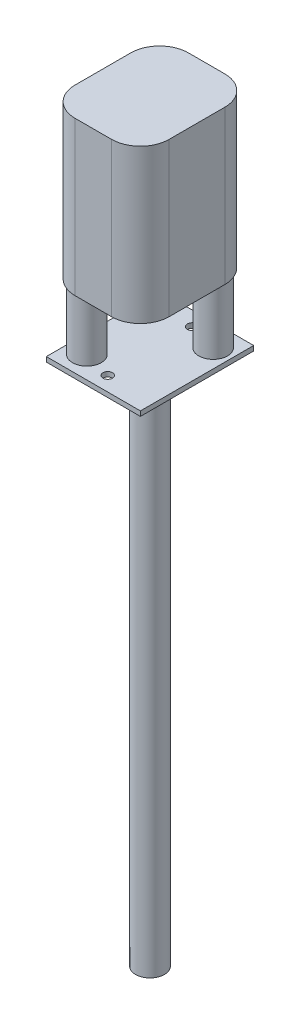
ISO-10303-21;
HEADER;
FILE_DESCRIPTION(('STEP AP214'),'2;1');
FILE_NAME('part.step','',(''),(''),'','','');
FILE_SCHEMA(('AUTOMOTIVE_DESIGN { 1 0 10303 214 1 1 1 1 }'));
ENDSEC;
DATA;
#1=APPLICATION_CONTEXT('core data for automotive mechanical design processes');
#2=APPLICATION_PROTOCOL_DEFINITION('international standard','automotive_design',2000,#1);
#3=PRODUCT_CONTEXT('',#1,'mechanical');
#4=PRODUCT('Part','Part','',(#3));
#5=PRODUCT_RELATED_PRODUCT_CATEGORY('part','',(#4));
#6=PRODUCT_DEFINITION_FORMATION('','',#4);
#7=PRODUCT_DEFINITION_CONTEXT('part definition',#1,'design');
#8=PRODUCT_DEFINITION('design','',#6,#7);
#9=PRODUCT_DEFINITION_SHAPE('','',#8);
#10=(LENGTH_UNIT() NAMED_UNIT(*) SI_UNIT(.MILLI.,.METRE.));
#11=(NAMED_UNIT(*) PLANE_ANGLE_UNIT() SI_UNIT($,.RADIAN.));
#12=(NAMED_UNIT(*) SI_UNIT($,.STERADIAN.) SOLID_ANGLE_UNIT());
#13=UNCERTAINTY_MEASURE_WITH_UNIT(LENGTH_MEASURE(1.E-05),#10,'distance_accuracy_value','');
#14=(GEOMETRIC_REPRESENTATION_CONTEXT(3) GLOBAL_UNCERTAINTY_ASSIGNED_CONTEXT((#13)) GLOBAL_UNIT_ASSIGNED_CONTEXT((#10,
#11,#12)) REPRESENTATION_CONTEXT('',''));
#15=CARTESIAN_POINT('',(0.,0.,0.));
#16=DIRECTION('',(0.,0.,1.));
#17=DIRECTION('',(1.,0.,0.));
#18=AXIS2_PLACEMENT_3D('',#15,#16,#17);
#19=CARTESIAN_POINT('',(-4.9,0.5,5.9));
#20=DIRECTION('',(1.,0.,0.));
#21=DIRECTION('',(0.,0.,-1.));
#22=AXIS2_PLACEMENT_3D('',#19,#20,#21);
#23=PLANE('',#22);
#24=DIRECTION('',(0.,0.,1.));
#25=VECTOR('',#24,1.);
#26=CARTESIAN_POINT('',(-4.9,0.,5.9));
#27=LINE('',#26,#25);
#28=CARTESIAN_POINT('',(-4.9,0.,-5.9));
#29=VERTEX_POINT('',#28);
#30=CARTESIAN_POINT('',(-4.9,0.,5.9));
#31=VERTEX_POINT('',#30);
#32=EDGE_CURVE('E190',#29,#31,#27,.T.);
#33=ORIENTED_EDGE('',*,*,#32,.T.);
#34=DIRECTION('',(0.,-1.,0.));
#35=VECTOR('',#34,1.);
#36=CARTESIAN_POINT('',(-4.9,0.5,5.9));
#37=LINE('',#36,#35);
#38=CARTESIAN_POINT('',(-4.9,0.5,5.9));
#39=VERTEX_POINT('',#38);
#40=EDGE_CURVE('E37',#39,#31,#37,.T.);
#41=ORIENTED_EDGE('',*,*,#40,.F.);
#42=DIRECTION('',(0.,0.,1.));
#43=VECTOR('',#42,1.);
#44=CARTESIAN_POINT('',(-4.9,0.5,5.9));
#45=LINE('',#44,#43);
#46=CARTESIAN_POINT('',(-4.9,0.5,-5.9));
#47=VERTEX_POINT('',#46);
#48=EDGE_CURVE('E192',#47,#39,#45,.T.);
#49=ORIENTED_EDGE('',*,*,#48,.F.);
#50=DIRECTION('',(0.,-1.,0.));
#51=VECTOR('',#50,1.);
#52=CARTESIAN_POINT('',(-4.9,0.5,-5.9));
#53=LINE('',#52,#51);
#54=EDGE_CURVE('E198',#47,#29,#53,.T.);
#55=ORIENTED_EDGE('',*,*,#54,.T.);
#56=EDGE_LOOP('',(#33,#41,#49,#55));
#57=FACE_BOUND('',#56,.T.);
#58=ADVANCED_FACE('F34',(#57),#23,.F.);
#59=CARTESIAN_POINT('',(4.9,0.5,5.9));
#60=DIRECTION('',(0.,0.,-1.));
#61=DIRECTION('',(-1.,0.,0.));
#62=AXIS2_PLACEMENT_3D('',#59,#60,#61);
#63=PLANE('',#62);
#64=DIRECTION('',(1.,0.,0.));
#65=VECTOR('',#64,1.);
#66=CARTESIAN_POINT('',(4.9,0.,5.9));
#67=LINE('',#66,#65);
#68=CARTESIAN_POINT('',(4.9,0.,5.9));
#69=VERTEX_POINT('',#68);
#70=EDGE_CURVE('E201',#31,#69,#67,.T.);
#71=ORIENTED_EDGE('',*,*,#70,.T.);
#72=DIRECTION('',(0.,-1.,0.));
#73=VECTOR('',#72,1.);
#74=CARTESIAN_POINT('',(4.9,0.5,5.9));
#75=LINE('',#74,#73);
#76=CARTESIAN_POINT('',(4.9,0.5,5.9));
#77=VERTEX_POINT('',#76);
#78=EDGE_CURVE('E207',#77,#69,#75,.T.);
#79=ORIENTED_EDGE('',*,*,#78,.F.);
#80=DIRECTION('',(1.,0.,0.));
#81=VECTOR('',#80,1.);
#82=CARTESIAN_POINT('',(4.9,0.5,5.9));
#83=LINE('',#82,#81);
#84=EDGE_CURVE('E83',#39,#77,#83,.T.);
#85=ORIENTED_EDGE('',*,*,#84,.F.);
#86=ORIENTED_EDGE('',*,*,#40,.T.);
#87=EDGE_LOOP('',(#71,#79,#85,#86));
#88=FACE_BOUND('',#87,.T.);
#89=ADVANCED_FACE('F210',(#88),#63,.F.);
#90=CARTESIAN_POINT('',(4.9,0.5,5.9));
#91=DIRECTION('',(-1.,0.,0.));
#92=DIRECTION('',(0.,0.,1.));
#93=AXIS2_PLACEMENT_3D('',#90,#91,#92);
#94=PLANE('',#93);
#95=DIRECTION('',(0.,0.,-1.));
#96=VECTOR('',#95,1.);
#97=CARTESIAN_POINT('',(4.9,0.,5.9));
#98=LINE('',#97,#96);
#99=CARTESIAN_POINT('',(4.9,0.,-5.9));
#100=VERTEX_POINT('',#99);
#101=EDGE_CURVE('E69',#69,#100,#98,.T.);
#102=ORIENTED_EDGE('',*,*,#101,.T.);
#103=DIRECTION('',(0.,-1.,0.));
#104=VECTOR('',#103,1.);
#105=CARTESIAN_POINT('',(4.9,0.5,-5.9));
#106=LINE('',#105,#104);
#107=CARTESIAN_POINT('',(4.9,0.5,-5.9));
#108=VERTEX_POINT('',#107);
#109=EDGE_CURVE('E206',#108,#100,#106,.T.);
#110=ORIENTED_EDGE('',*,*,#109,.F.);
#111=DIRECTION('',(0.,0.,-1.));
#112=VECTOR('',#111,1.);
#113=CARTESIAN_POINT('',(4.9,0.5,5.9));
#114=LINE('',#113,#112);
#115=EDGE_CURVE('E195',#77,#108,#114,.T.);
#116=ORIENTED_EDGE('',*,*,#115,.F.);
#117=ORIENTED_EDGE('',*,*,#78,.T.);
#118=EDGE_LOOP('',(#102,#110,#116,#117));
#119=FACE_BOUND('',#118,.T.);
#120=ADVANCED_FACE('F238',(#119),#94,.F.);
#121=CARTESIAN_POINT('',(4.9,0.5,-5.9));
#122=DIRECTION('',(0.,0.,1.));
#123=DIRECTION('',(1.,0.,0.));
#124=AXIS2_PLACEMENT_3D('',#121,#122,#123);
#125=PLANE('',#124);
#126=DIRECTION('',(-1.,0.,0.));
#127=VECTOR('',#126,1.);
#128=CARTESIAN_POINT('',(4.9,0.,-5.9));
#129=LINE('',#128,#127);
#130=EDGE_CURVE('E75',#100,#29,#129,.T.);
#131=ORIENTED_EDGE('',*,*,#130,.T.);
#132=ORIENTED_EDGE('',*,*,#54,.F.);
#133=DIRECTION('',(-1.,0.,0.));
#134=VECTOR('',#133,1.);
#135=CARTESIAN_POINT('',(4.9,0.5,-5.9));
#136=LINE('',#135,#134);
#137=EDGE_CURVE('E51',#108,#47,#136,.T.);
#138=ORIENTED_EDGE('',*,*,#137,.F.);
#139=ORIENTED_EDGE('',*,*,#109,.T.);
#140=EDGE_LOOP('',(#131,#132,#138,#139));
#141=FACE_BOUND('',#140,.T.);
#142=ADVANCED_FACE('F228',(#141),#125,.F.);
#143=CARTESIAN_POINT('',(0.,0.5,0.));
#144=DIRECTION('',(0.,1.,0.));
#145=DIRECTION('',(0.,0.,1.));
#146=AXIS2_PLACEMENT_3D('',#143,#144,#145);
#147=PLANE('',#146);
#148=CARTESIAN_POINT('',(2.98329699091761,0.5,-3.59213311151304));
#149=DIRECTION('',(0.,1.,0.));
#150=DIRECTION('',(0.,0.,-1.));
#151=AXIS2_PLACEMENT_3D('',#148,#149,#150);
#152=CIRCLE('',#151,1.5);
#153=CARTESIAN_POINT('',(2.98329699091761,0.5,-5.09213311151304));
#154=VERTEX_POINT('',#153);
#155=EDGE_CURVE('E159',#154,#154,#152,.T.);
#156=ORIENTED_EDGE('',*,*,#155,.F.);
#157=EDGE_LOOP('',(#156));
#158=FACE_BOUND('',#157,.T.);
#159=CARTESIAN_POINT('',(-2.98329699091761,0.5,3.59213311151304));
#160=DIRECTION('',(0.,1.,0.));
#161=DIRECTION('',(0.,0.,1.));
#162=AXIS2_PLACEMENT_3D('',#159,#160,#161);
#163=CIRCLE('',#162,1.5);
#164=CARTESIAN_POINT('',(-2.98329699091761,0.5,5.09213311151304));
#165=VERTEX_POINT('',#164);
#166=EDGE_CURVE('E169',#165,#165,#163,.T.);
#167=ORIENTED_EDGE('',*,*,#166,.F.);
#168=EDGE_LOOP('',(#167));
#169=FACE_BOUND('',#168,.T.);
#170=CARTESIAN_POINT('',(0.,0.5,4.4));
#171=DIRECTION('',(0.,1.,0.));
#172=DIRECTION('',(0.,0.,1.));
#173=AXIS2_PLACEMENT_3D('',#170,#171,#172);
#174=CIRCLE('',#173,0.5);
#175=CARTESIAN_POINT('',(0.,0.5,4.9));
#176=VERTEX_POINT('',#175);
#177=EDGE_CURVE('E185',#176,#176,#174,.T.);
#178=ORIENTED_EDGE('',*,*,#177,.F.);
#179=EDGE_LOOP('',(#178));
#180=FACE_BOUND('',#179,.T.);
#181=CARTESIAN_POINT('',(0.,0.5,-4.4));
#182=DIRECTION('',(0.,1.,0.));
#183=DIRECTION('',(0.,0.,1.));
#184=AXIS2_PLACEMENT_3D('',#181,#182,#183);
#185=CIRCLE('',#184,0.5);
#186=CARTESIAN_POINT('',(0.,0.5,-3.9));
#187=VERTEX_POINT('',#186);
#188=EDGE_CURVE('E180',#187,#187,#185,.T.);
#189=ORIENTED_EDGE('',*,*,#188,.F.);
#190=EDGE_LOOP('',(#189));
#191=FACE_BOUND('',#190,.T.);
#192=ORIENTED_EDGE('',*,*,#48,.T.);
#193=ORIENTED_EDGE('',*,*,#84,.T.);
#194=ORIENTED_EDGE('',*,*,#115,.T.);
#195=ORIENTED_EDGE('',*,*,#137,.T.);
#196=EDGE_LOOP('',(#192,#193,#194,#195));
#197=FACE_BOUND('',#196,.T.);
#198=ADVANCED_FACE('F218',(#158,#169,#180,#191,#197),#147,.T.);
#199=CARTESIAN_POINT('',(0.,0.,0.));
#200=DIRECTION('',(0.,1.,0.));
#201=DIRECTION('',(0.,0.,1.));
#202=AXIS2_PLACEMENT_3D('',#199,#200,#201);
#203=PLANE('',#202);
#204=CARTESIAN_POINT('',(0.,0.,4.4));
#205=DIRECTION('',(0.,-1.,0.));
#206=DIRECTION('',(0.,0.,-1.));
#207=AXIS2_PLACEMENT_3D('',#204,#205,#206);
#208=CIRCLE('',#207,0.5);
#209=CARTESIAN_POINT('',(0.,0.,3.9));
#210=VERTEX_POINT('',#209);
#211=EDGE_CURVE('E177',#210,#210,#208,.T.);
#212=ORIENTED_EDGE('',*,*,#211,.F.);
#213=EDGE_LOOP('',(#212));
#214=FACE_BOUND('',#213,.T.);
#215=CARTESIAN_POINT('',(0.,0.,-4.4));
#216=DIRECTION('',(0.,-1.,0.));
#217=DIRECTION('',(0.,0.,1.));
#218=AXIS2_PLACEMENT_3D('',#215,#216,#217);
#219=CIRCLE('',#218,0.5);
#220=CARTESIAN_POINT('',(0.,0.,-3.9));
#221=VERTEX_POINT('',#220);
#222=EDGE_CURVE('E174',#221,#221,#219,.T.);
#223=ORIENTED_EDGE('',*,*,#222,.F.);
#224=EDGE_LOOP('',(#223));
#225=FACE_BOUND('',#224,.T.);
#226=CARTESIAN_POINT('',(0.,0.,0.));
#227=DIRECTION('',(0.,-1.,0.));
#228=DIRECTION('',(0.,0.,-1.));
#229=AXIS2_PLACEMENT_3D('',#226,#227,#228);
#230=CIRCLE('',#229,1.5);
#231=CARTESIAN_POINT('',(0.,0.,-1.5));
#232=VERTEX_POINT('',#231);
#233=EDGE_CURVE('E11',#232,#232,#230,.T.);
#234=ORIENTED_EDGE('',*,*,#233,.F.);
#235=EDGE_LOOP('',(#234));
#236=FACE_BOUND('',#235,.T.);
#237=ORIENTED_EDGE('',*,*,#32,.F.);
#238=ORIENTED_EDGE('',*,*,#130,.F.);
#239=ORIENTED_EDGE('',*,*,#101,.F.);
#240=ORIENTED_EDGE('',*,*,#70,.F.);
#241=EDGE_LOOP('',(#237,#238,#239,#240));
#242=FACE_BOUND('',#241,.T.);
#243=ADVANCED_FACE('F215',(#214,#225,#236,#242),#203,.F.);
#244=CARTESIAN_POINT('',(0.,-55.,0.));
#245=DIRECTION('',(0.,1.,0.));
#246=DIRECTION('',(0.,0.,1.));
#247=AXIS2_PLACEMENT_3D('',#244,#245,#246);
#248=CYLINDRICAL_SURFACE('',#247,1.5);
#249=CARTESIAN_POINT('',(0.,-55.,0.));
#250=DIRECTION('',(0.,-1.,0.));
#251=DIRECTION('',(0.,0.,-1.));
#252=AXIS2_PLACEMENT_3D('',#249,#250,#251);
#253=CIRCLE('',#252,1.5);
#254=CARTESIAN_POINT('',(0.,-55.,-1.5));
#255=VERTEX_POINT('',#254);
#256=EDGE_CURVE('E188',#255,#255,#253,.T.);
#257=ORIENTED_EDGE('',*,*,#256,.F.);
#258=EDGE_LOOP('',(#257));
#259=FACE_BOUND('',#258,.T.);
#260=ORIENTED_EDGE('',*,*,#233,.T.);
#261=EDGE_LOOP('',(#260));
#262=FACE_BOUND('',#261,.T.);
#263=ADVANCED_FACE('F217',(#259,#262),#248,.T.);
#264=CARTESIAN_POINT('',(0.,-55.,0.));
#265=DIRECTION('',(0.,-1.,0.));
#266=DIRECTION('',(0.,0.,-1.));
#267=AXIS2_PLACEMENT_3D('',#264,#265,#266);
#268=PLANE('',#267);
#269=ORIENTED_EDGE('',*,*,#256,.T.);
#270=EDGE_LOOP('',(#269));
#271=FACE_BOUND('',#270,.T.);
#272=ADVANCED_FACE('F225',(#271),#268,.T.);
#273=CARTESIAN_POINT('',(0.,55.,-4.4));
#274=DIRECTION('',(0.,-1.,0.));
#275=DIRECTION('',(0.,0.,-1.));
#276=AXIS2_PLACEMENT_3D('',#273,#274,#275);
#277=CYLINDRICAL_SURFACE('',#276,0.5);
#278=ORIENTED_EDGE('',*,*,#188,.T.);
#279=EDGE_LOOP('',(#278));
#280=FACE_BOUND('',#279,.T.);
#281=ORIENTED_EDGE('',*,*,#222,.T.);
#282=EDGE_LOOP('',(#281));
#283=FACE_BOUND('',#282,.T.);
#284=ADVANCED_FACE('F381',(#280,#283),#277,.F.);
#285=CARTESIAN_POINT('',(0.,55.,4.4));
#286=DIRECTION('',(0.,-1.,0.));
#287=DIRECTION('',(0.,0.,-1.));
#288=AXIS2_PLACEMENT_3D('',#285,#286,#287);
#289=CYLINDRICAL_SURFACE('',#288,0.5);
#290=ORIENTED_EDGE('',*,*,#177,.T.);
#291=EDGE_LOOP('',(#290));
#292=FACE_BOUND('',#291,.T.);
#293=ORIENTED_EDGE('',*,*,#211,.T.);
#294=EDGE_LOOP('',(#293));
#295=FACE_BOUND('',#294,.T.);
#296=ADVANCED_FACE('F260',(#292,#295),#289,.F.);
#297=CARTESIAN_POINT('',(-2.98329699091761,7.5,3.59213311151304));
#298=DIRECTION('',(0.,-1.,0.));
#299=DIRECTION('',(0.,0.,-1.));
#300=AXIS2_PLACEMENT_3D('',#297,#298,#299);
#301=CYLINDRICAL_SURFACE('',#300,1.5);
#302=CARTESIAN_POINT('',(-2.98329699091761,7.5,3.59213311151304));
#303=DIRECTION('',(0.,1.,0.));
#304=DIRECTION('',(0.,0.,1.));
#305=AXIS2_PLACEMENT_3D('',#302,#303,#304);
#306=CIRCLE('',#305,1.5);
#307=CARTESIAN_POINT('',(-2.98329699091761,7.5,5.09213311151304));
#308=VERTEX_POINT('',#307);
#309=EDGE_CURVE('E171',#308,#308,#306,.T.);
#310=ORIENTED_EDGE('',*,*,#309,.F.);
#311=EDGE_LOOP('',(#310));
#312=FACE_BOUND('',#311,.T.);
#313=ORIENTED_EDGE('',*,*,#166,.T.);
#314=EDGE_LOOP('',(#313));
#315=FACE_BOUND('',#314,.T.);
#316=ADVANCED_FACE('F265',(#312,#315),#301,.T.);
#317=CARTESIAN_POINT('',(2.98329699091761,7.5,-3.59213311151304));
#318=DIRECTION('',(0.,-1.,0.));
#319=DIRECTION('',(0.,0.,-1.));
#320=AXIS2_PLACEMENT_3D('',#317,#318,#319);
#321=CYLINDRICAL_SURFACE('',#320,1.5);
#322=CARTESIAN_POINT('',(2.98329699091761,7.5,-3.59213311151304));
#323=DIRECTION('',(0.,1.,0.));
#324=DIRECTION('',(0.,0.,-1.));
#325=AXIS2_PLACEMENT_3D('',#322,#323,#324);
#326=CIRCLE('',#325,1.5);
#327=CARTESIAN_POINT('',(2.98329699091761,7.5,-5.09213311151304));
#328=VERTEX_POINT('',#327);
#329=EDGE_CURVE('E162',#328,#328,#326,.T.);
#330=ORIENTED_EDGE('',*,*,#329,.F.);
#331=EDGE_LOOP('',(#330));
#332=FACE_BOUND('',#331,.T.);
#333=ORIENTED_EDGE('',*,*,#155,.T.);
#334=EDGE_LOOP('',(#333));
#335=FACE_BOUND('',#334,.T.);
#336=ADVANCED_FACE('F270',(#332,#335),#321,.T.);
#337=CARTESIAN_POINT('',(-1.9,23.5,-2.9));
#338=DIRECTION('',(0.,-1.,0.));
#339=DIRECTION('',(0.,0.,-1.));
#340=AXIS2_PLACEMENT_3D('',#337,#338,#339);
#341=CYLINDRICAL_SURFACE('',#340,3.);
#342=CARTESIAN_POINT('',(-1.9,7.5,-2.9));
#343=DIRECTION('',(0.,1.,0.));
#344=DIRECTION('',(0.,0.,1.));
#345=AXIS2_PLACEMENT_3D('',#342,#343,#344);
#346=CIRCLE('',#345,3.);
#347=CARTESIAN_POINT('',(-1.89999999999998,7.5,-5.9));
#348=VERTEX_POINT('',#347);
#349=CARTESIAN_POINT('',(-4.9,7.5,-2.89999999999998));
#350=VERTEX_POINT('',#349);
#351=EDGE_CURVE('E158',#348,#350,#346,.T.);
#352=ORIENTED_EDGE('',*,*,#351,.T.);
#353=DIRECTION('',(0.,-1.,0.));
#354=VECTOR('',#353,1.);
#355=CARTESIAN_POINT('',(-4.9,23.5,-2.89999999999998));
#356=LINE('',#355,#354);
#357=CARTESIAN_POINT('',(-4.9,23.5,-2.89999999999998));
#358=VERTEX_POINT('',#357);
#359=EDGE_CURVE('E138',#358,#350,#356,.T.);
#360=ORIENTED_EDGE('',*,*,#359,.F.);
#361=CARTESIAN_POINT('',(-1.9,23.5,-2.9));
#362=DIRECTION('',(0.,1.,0.));
#363=DIRECTION('',(0.,0.,1.));
#364=AXIS2_PLACEMENT_3D('',#361,#362,#363);
#365=CIRCLE('',#364,3.);
#366=CARTESIAN_POINT('',(-1.89999999999998,23.5,-5.9));
#367=VERTEX_POINT('',#366);
#368=EDGE_CURVE('E145',#367,#358,#365,.T.);
#369=ORIENTED_EDGE('',*,*,#368,.F.);
#370=DIRECTION('',(0.,-1.,0.));
#371=VECTOR('',#370,1.);
#372=CARTESIAN_POINT('',(-1.89999999999998,23.5,-5.9));
#373=LINE('',#372,#371);
#374=EDGE_CURVE('E444',#367,#348,#373,.T.);
#375=ORIENTED_EDGE('',*,*,#374,.T.);
#376=EDGE_LOOP('',(#352,#360,#369,#375));
#377=FACE_BOUND('',#376,.T.);
#378=ADVANCED_FACE('F156',(#377),#341,.T.);
#379=CARTESIAN_POINT('',(-4.9,23.5,-2.89999999999998));
#380=DIRECTION('',(1.,0.,0.));
#381=DIRECTION('',(0.,0.,-1.));
#382=AXIS2_PLACEMENT_3D('',#379,#380,#381);
#383=PLANE('',#382);
#384=DIRECTION('',(0.,0.,1.));
#385=VECTOR('',#384,1.);
#386=CARTESIAN_POINT('',(-4.9,7.5,-2.89999999999998));
#387=LINE('',#386,#385);
#388=CARTESIAN_POINT('',(-4.9,7.5,2.90712827563198));
#389=VERTEX_POINT('',#388);
#390=EDGE_CURVE('E427',#350,#389,#387,.T.);
#391=ORIENTED_EDGE('',*,*,#390,.T.);
#392=DIRECTION('',(0.,-1.,0.));
#393=VECTOR('',#392,1.);
#394=CARTESIAN_POINT('',(-4.9,23.5,2.90712827563198));
#395=LINE('',#394,#393);
#396=CARTESIAN_POINT('',(-4.9,23.5,2.90712827563198));
#397=VERTEX_POINT('',#396);
#398=EDGE_CURVE('E141',#397,#389,#395,.T.);
#399=ORIENTED_EDGE('',*,*,#398,.F.);
#400=DIRECTION('',(0.,0.,1.));
#401=VECTOR('',#400,1.);
#402=CARTESIAN_POINT('',(-4.9,23.5,-2.89999999999998));
#403=LINE('',#402,#401);
#404=EDGE_CURVE('E134',#358,#397,#403,.T.);
#405=ORIENTED_EDGE('',*,*,#404,.F.);
#406=ORIENTED_EDGE('',*,*,#359,.T.);
#407=EDGE_LOOP('',(#391,#399,#405,#406));
#408=FACE_BOUND('',#407,.T.);
#409=ADVANCED_FACE('F136',(#408),#383,.F.);
#410=CARTESIAN_POINT('',(-1.9,23.5,2.907128275632));
#411=DIRECTION('',(0.,-1.,0.));
#412=DIRECTION('',(0.,0.,-1.));
#413=AXIS2_PLACEMENT_3D('',#410,#411,#412);
#414=CYLINDRICAL_SURFACE('',#413,3.);
#415=CARTESIAN_POINT('',(-1.9,7.5,2.907128275632));
#416=DIRECTION('',(0.,1.,0.));
#417=DIRECTION('',(0.,0.,-1.));
#418=AXIS2_PLACEMENT_3D('',#415,#416,#417);
#419=CIRCLE('',#418,3.);
#420=CARTESIAN_POINT('',(-1.89999999999998,7.5,5.907128275632));
#421=VERTEX_POINT('',#420);
#422=EDGE_CURVE('E429',#389,#421,#419,.T.);
#423=ORIENTED_EDGE('',*,*,#422,.T.);
#424=DIRECTION('',(0.,-1.,0.));
#425=VECTOR('',#424,1.);
#426=CARTESIAN_POINT('',(-1.89999999999998,23.5,5.907128275632));
#427=LINE('',#426,#425);
#428=CARTESIAN_POINT('',(-1.89999999999998,23.5,5.907128275632));
#429=VERTEX_POINT('',#428);
#430=EDGE_CURVE('E164',#429,#421,#427,.T.);
#431=ORIENTED_EDGE('',*,*,#430,.F.);
#432=CARTESIAN_POINT('',(-1.9,23.5,2.907128275632));
#433=DIRECTION('',(0.,1.,0.));
#434=DIRECTION('',(0.,0.,-1.));
#435=AXIS2_PLACEMENT_3D('',#432,#433,#434);
#436=CIRCLE('',#435,3.);
#437=EDGE_CURVE('E144',#397,#429,#436,.T.);
#438=ORIENTED_EDGE('',*,*,#437,.F.);
#439=ORIENTED_EDGE('',*,*,#398,.T.);
#440=EDGE_LOOP('',(#423,#431,#438,#439));
#441=FACE_BOUND('',#440,.T.);
#442=ADVANCED_FACE('F297',(#441),#414,.T.);
#443=CARTESIAN_POINT('',(-1.89999999999998,23.5,5.907128275632));
#444=DIRECTION('',(0.,0.,-1.));
#445=DIRECTION('',(-1.,0.,0.));
#446=AXIS2_PLACEMENT_3D('',#443,#444,#445);
#447=PLANE('',#446);
#448=DIRECTION('',(1.,0.,0.));
#449=VECTOR('',#448,1.);
#450=CARTESIAN_POINT('',(-1.89999999999998,7.5,5.907128275632));
#451=LINE('',#450,#449);
#452=CARTESIAN_POINT('',(1.89999999999998,7.5,5.907128275632));
#453=VERTEX_POINT('',#452);
#454=EDGE_CURVE('E435',#421,#453,#451,.T.);
#455=ORIENTED_EDGE('',*,*,#454,.T.);
#456=DIRECTION('',(0.,-1.,0.));
#457=VECTOR('',#456,1.);
#458=CARTESIAN_POINT('',(1.89999999999998,23.5,5.907128275632));
#459=LINE('',#458,#457);
#460=CARTESIAN_POINT('',(1.89999999999998,23.5,5.907128275632));
#461=VERTEX_POINT('',#460);
#462=EDGE_CURVE('E455',#461,#453,#459,.T.);
#463=ORIENTED_EDGE('',*,*,#462,.F.);
#464=DIRECTION('',(1.,0.,0.));
#465=VECTOR('',#464,1.);
#466=CARTESIAN_POINT('',(-1.89999999999998,23.5,5.907128275632));
#467=LINE('',#466,#465);
#468=EDGE_CURVE('E462',#429,#461,#467,.T.);
#469=ORIENTED_EDGE('',*,*,#468,.F.);
#470=ORIENTED_EDGE('',*,*,#430,.T.);
#471=EDGE_LOOP('',(#455,#463,#469,#470));
#472=FACE_BOUND('',#471,.T.);
#473=ADVANCED_FACE('F306',(#472),#447,.F.);
#474=CARTESIAN_POINT('',(1.9,23.5,2.907128275632));
#475=DIRECTION('',(0.,-1.,0.));
#476=DIRECTION('',(0.,0.,-1.));
#477=AXIS2_PLACEMENT_3D('',#474,#475,#476);
#478=CYLINDRICAL_SURFACE('',#477,3.);
#479=CARTESIAN_POINT('',(1.9,7.5,2.907128275632));
#480=DIRECTION('',(0.,1.,0.));
#481=DIRECTION('',(0.,0.,1.));
#482=AXIS2_PLACEMENT_3D('',#479,#480,#481);
#483=CIRCLE('',#482,3.);
#484=CARTESIAN_POINT('',(4.9,7.5,2.90712827563197));
#485=VERTEX_POINT('',#484);
#486=EDGE_CURVE('E437',#453,#485,#483,.T.);
#487=ORIENTED_EDGE('',*,*,#486,.T.);
#488=DIRECTION('',(0.,-1.,0.));
#489=VECTOR('',#488,1.);
#490=CARTESIAN_POINT('',(4.9,23.5,2.90712827563197));
#491=LINE('',#490,#489);
#492=CARTESIAN_POINT('',(4.9,23.5,2.90712827563197));
#493=VERTEX_POINT('',#492);
#494=EDGE_CURVE('E452',#493,#485,#491,.T.);
#495=ORIENTED_EDGE('',*,*,#494,.F.);
#496=CARTESIAN_POINT('',(1.9,23.5,2.907128275632));
#497=DIRECTION('',(0.,1.,0.));
#498=DIRECTION('',(0.,0.,1.));
#499=AXIS2_PLACEMENT_3D('',#496,#497,#498);
#500=CIRCLE('',#499,3.);
#501=EDGE_CURVE('E472',#461,#493,#500,.T.);
#502=ORIENTED_EDGE('',*,*,#501,.F.);
#503=ORIENTED_EDGE('',*,*,#462,.T.);
#504=EDGE_LOOP('',(#487,#495,#502,#503));
#505=FACE_BOUND('',#504,.T.);
#506=ADVANCED_FACE('F316',(#505),#478,.T.);
#507=CARTESIAN_POINT('',(4.9,23.5,-2.89999999999998));
#508=DIRECTION('',(-1.,0.,0.));
#509=DIRECTION('',(0.,0.,1.));
#510=AXIS2_PLACEMENT_3D('',#507,#508,#509);
#511=PLANE('',#510);
#512=DIRECTION('',(0.,0.,-1.));
#513=VECTOR('',#512,1.);
#514=CARTESIAN_POINT('',(4.9,7.5,-2.89999999999998));
#515=LINE('',#514,#513);
#516=CARTESIAN_POINT('',(4.9,7.5,-2.89999999999998));
#517=VERTEX_POINT('',#516);
#518=EDGE_CURVE('E439',#485,#517,#515,.T.);
#519=ORIENTED_EDGE('',*,*,#518,.T.);
#520=DIRECTION('',(0.,-1.,0.));
#521=VECTOR('',#520,1.);
#522=CARTESIAN_POINT('',(4.9,23.5,-2.89999999999998));
#523=LINE('',#522,#521);
#524=CARTESIAN_POINT('',(4.9,23.5,-2.89999999999998));
#525=VERTEX_POINT('',#524);
#526=EDGE_CURVE('E449',#525,#517,#523,.T.);
#527=ORIENTED_EDGE('',*,*,#526,.F.);
#528=DIRECTION('',(0.,0.,-1.));
#529=VECTOR('',#528,1.);
#530=CARTESIAN_POINT('',(4.9,23.5,-2.89999999999998));
#531=LINE('',#530,#529);
#532=EDGE_CURVE('E469',#493,#525,#531,.T.);
#533=ORIENTED_EDGE('',*,*,#532,.F.);
#534=ORIENTED_EDGE('',*,*,#494,.T.);
#535=EDGE_LOOP('',(#519,#527,#533,#534));
#536=FACE_BOUND('',#535,.T.);
#537=ADVANCED_FACE('F326',(#536),#511,.F.);
#538=CARTESIAN_POINT('',(1.9,23.5,-2.9));
#539=DIRECTION('',(0.,-1.,0.));
#540=DIRECTION('',(0.,0.,-1.));
#541=AXIS2_PLACEMENT_3D('',#538,#539,#540);
#542=CYLINDRICAL_SURFACE('',#541,3.);
#543=CARTESIAN_POINT('',(1.9,7.5,-2.9));
#544=DIRECTION('',(0.,1.,0.));
#545=DIRECTION('',(0.,0.,1.));
#546=AXIS2_PLACEMENT_3D('',#543,#544,#545);
#547=CIRCLE('',#546,3.);
#548=CARTESIAN_POINT('',(1.89999999999998,7.5,-5.9));
#549=VERTEX_POINT('',#548);
#550=EDGE_CURVE('E441',#517,#549,#547,.T.);
#551=ORIENTED_EDGE('',*,*,#550,.T.);
#552=DIRECTION('',(0.,-1.,0.));
#553=VECTOR('',#552,1.);
#554=CARTESIAN_POINT('',(1.89999999999998,23.5,-5.9));
#555=LINE('',#554,#553);
#556=CARTESIAN_POINT('',(1.89999999999998,23.5,-5.9));
#557=VERTEX_POINT('',#556);
#558=EDGE_CURVE('E446',#557,#549,#555,.T.);
#559=ORIENTED_EDGE('',*,*,#558,.F.);
#560=CARTESIAN_POINT('',(1.9,23.5,-2.9));
#561=DIRECTION('',(0.,1.,0.));
#562=DIRECTION('',(0.,0.,1.));
#563=AXIS2_PLACEMENT_3D('',#560,#561,#562);
#564=CIRCLE('',#563,3.);
#565=EDGE_CURVE('E471',#525,#557,#564,.T.);
#566=ORIENTED_EDGE('',*,*,#565,.F.);
#567=ORIENTED_EDGE('',*,*,#526,.T.);
#568=EDGE_LOOP('',(#551,#559,#566,#567));
#569=FACE_BOUND('',#568,.T.);
#570=ADVANCED_FACE('F336',(#569),#542,.T.);
#571=CARTESIAN_POINT('',(-1.89999999999998,23.5,-5.9));
#572=DIRECTION('',(0.,0.,1.));
#573=DIRECTION('',(1.,0.,0.));
#574=AXIS2_PLACEMENT_3D('',#571,#572,#573);
#575=PLANE('',#574);
#576=DIRECTION('',(-1.,0.,0.));
#577=VECTOR('',#576,1.);
#578=CARTESIAN_POINT('',(-1.89999999999998,7.5,-5.9));
#579=LINE('',#578,#577);
#580=EDGE_CURVE('E154',#549,#348,#579,.T.);
#581=ORIENTED_EDGE('',*,*,#580,.T.);
#582=ORIENTED_EDGE('',*,*,#374,.F.);
#583=DIRECTION('',(-1.,0.,0.));
#584=VECTOR('',#583,1.);
#585=CARTESIAN_POINT('',(-1.89999999999998,23.5,-5.9));
#586=LINE('',#585,#584);
#587=EDGE_CURVE('E150',#557,#367,#586,.T.);
#588=ORIENTED_EDGE('',*,*,#587,.F.);
#589=ORIENTED_EDGE('',*,*,#558,.T.);
#590=EDGE_LOOP('',(#581,#582,#588,#589));
#591=FACE_BOUND('',#590,.T.);
#592=ADVANCED_FACE('F346',(#591),#575,.F.);
#593=CARTESIAN_POINT('',(-1.9,23.5,-2.9));
#594=DIRECTION('',(0.,1.,0.));
#595=DIRECTION('',(0.,0.,1.));
#596=AXIS2_PLACEMENT_3D('',#593,#594,#595);
#597=PLANE('',#596);
#598=ORIENTED_EDGE('',*,*,#368,.T.);
#599=ORIENTED_EDGE('',*,*,#404,.T.);
#600=ORIENTED_EDGE('',*,*,#437,.T.);
#601=ORIENTED_EDGE('',*,*,#468,.T.);
#602=ORIENTED_EDGE('',*,*,#501,.T.);
#603=ORIENTED_EDGE('',*,*,#532,.T.);
#604=ORIENTED_EDGE('',*,*,#565,.T.);
#605=ORIENTED_EDGE('',*,*,#587,.T.);
#606=EDGE_LOOP('',(#598,#599,#600,#601,#602,#603,#604,#605));
#607=FACE_BOUND('',#606,.T.);
#608=ADVANCED_FACE('F148',(#607),#597,.T.);
#609=CARTESIAN_POINT('',(-1.9,7.5,-2.9));
#610=DIRECTION('',(0.,1.,0.));
#611=DIRECTION('',(0.,0.,1.));
#612=AXIS2_PLACEMENT_3D('',#609,#610,#611);
#613=PLANE('',#612);
#614=ORIENTED_EDGE('',*,*,#309,.T.);
#615=EDGE_LOOP('',(#614));
#616=FACE_BOUND('',#615,.T.);
#617=ORIENTED_EDGE('',*,*,#329,.T.);
#618=EDGE_LOOP('',(#617));
#619=FACE_BOUND('',#618,.T.);
#620=ORIENTED_EDGE('',*,*,#351,.F.);
#621=ORIENTED_EDGE('',*,*,#580,.F.);
#622=ORIENTED_EDGE('',*,*,#550,.F.);
#623=ORIENTED_EDGE('',*,*,#518,.F.);
#624=ORIENTED_EDGE('',*,*,#486,.F.);
#625=ORIENTED_EDGE('',*,*,#454,.F.);
#626=ORIENTED_EDGE('',*,*,#422,.F.);
#627=ORIENTED_EDGE('',*,*,#390,.F.);
#628=EDGE_LOOP('',(#620,#621,#622,#623,#624,#625,#626,#627));
#629=FACE_BOUND('',#628,.T.);
#630=ADVANCED_FACE('F365',(#616,#619,#629),#613,.F.);
#631=CLOSED_SHELL('',(#58,#89,#120,#142,#198,#243,#263,#272,#284,#296,#316,#336,#378,#409,#442,
#473,#506,#537,#570,#592,#608,#630));
#632=MANIFOLD_SOLID_BREP('B2',#631);
#633=ADVANCED_BREP_SHAPE_REPRESENTATION('',(#18,#632),#14);
#634=SHAPE_DEFINITION_REPRESENTATION(#9,#633);
ENDSEC;
END-ISO-10303-21;
